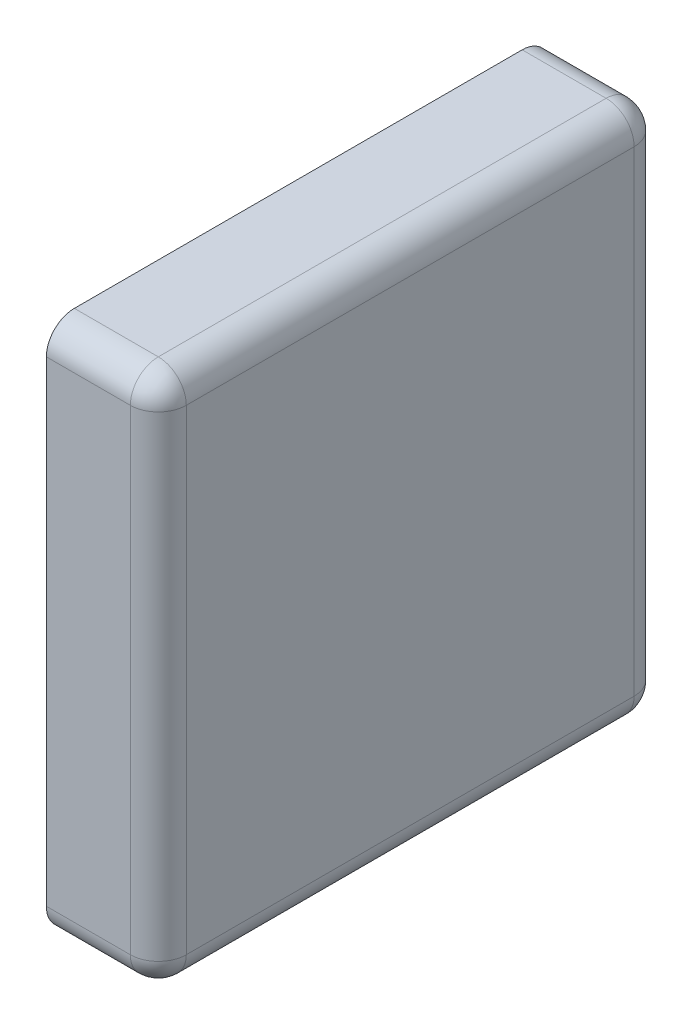
ISO-10303-21;
HEADER;
FILE_DESCRIPTION(('STEP AP214'),'2;1');
FILE_NAME('part.step','',(''),(''),'','','');
FILE_SCHEMA(('AUTOMOTIVE_DESIGN { 1 0 10303 214 1 1 1 1 }'));
ENDSEC;
DATA;
#1=APPLICATION_CONTEXT('core data for automotive mechanical design processes');
#2=APPLICATION_PROTOCOL_DEFINITION('international standard','automotive_design',2000,#1);
#3=PRODUCT_CONTEXT('',#1,'mechanical');
#4=PRODUCT('Part','Part','',(#3));
#5=PRODUCT_RELATED_PRODUCT_CATEGORY('part','',(#4));
#6=PRODUCT_DEFINITION_FORMATION('','',#4);
#7=PRODUCT_DEFINITION_CONTEXT('part definition',#1,'design');
#8=PRODUCT_DEFINITION('design','',#6,#7);
#9=PRODUCT_DEFINITION_SHAPE('','',#8);
#10=(LENGTH_UNIT() NAMED_UNIT(*) SI_UNIT(.MILLI.,.METRE.));
#11=(NAMED_UNIT(*) PLANE_ANGLE_UNIT() SI_UNIT($,.RADIAN.));
#12=(NAMED_UNIT(*) SI_UNIT($,.STERADIAN.) SOLID_ANGLE_UNIT());
#13=UNCERTAINTY_MEASURE_WITH_UNIT(LENGTH_MEASURE(1.E-05),#10,'distance_accuracy_value','');
#14=(GEOMETRIC_REPRESENTATION_CONTEXT(3) GLOBAL_UNCERTAINTY_ASSIGNED_CONTEXT((#13)) GLOBAL_UNIT_ASSIGNED_CONTEXT((#10,
#11,#12)) REPRESENTATION_CONTEXT('',''));
#15=CARTESIAN_POINT('',(0.,0.,0.));
#16=DIRECTION('',(0.,0.,1.));
#17=DIRECTION('',(1.,0.,0.));
#18=AXIS2_PLACEMENT_3D('',#15,#16,#17);
#19=CARTESIAN_POINT('',(1.75,0.,0.));
#20=DIRECTION('',(1.,0.,0.));
#21=DIRECTION('',(0.,0.,-1.));
#22=AXIS2_PLACEMENT_3D('',#19,#20,#21);
#23=PLANE('',#22);
#24=DIRECTION('',(0.,0.,1.));
#25=VECTOR('',#24,1.);
#26=CARTESIAN_POINT('',(1.75,0.9,0.));
#27=LINE('',#26,#25);
#28=CARTESIAN_POINT('',(1.75,0.9,0.85));
#29=VERTEX_POINT('',#28);
#30=CARTESIAN_POINT('',(1.75,0.9,0.05));
#31=VERTEX_POINT('',#30);
#32=EDGE_CURVE('E175',#29,#31,#27,.F.);
#33=ORIENTED_EDGE('',*,*,#32,.F.);
#34=DIRECTION('',(0.,1.,0.));
#35=VECTOR('',#34,1.);
#36=CARTESIAN_POINT('',(1.75,0.,0.85));
#37=LINE('',#36,#35);
#38=CARTESIAN_POINT('',(1.75,0.05,0.85));
#39=VERTEX_POINT('',#38);
#40=EDGE_CURVE('E165',#39,#29,#37,.T.);
#41=ORIENTED_EDGE('',*,*,#40,.F.);
#42=DIRECTION('',(0.,0.,1.));
#43=VECTOR('',#42,1.);
#44=CARTESIAN_POINT('',(1.75,0.05,0.));
#45=LINE('',#44,#43);
#46=CARTESIAN_POINT('',(1.75,0.05,0.05));
#47=VERTEX_POINT('',#46);
#48=EDGE_CURVE('E211',#47,#39,#45,.T.);
#49=ORIENTED_EDGE('',*,*,#48,.F.);
#50=DIRECTION('',(0.,1.,0.));
#51=VECTOR('',#50,1.);
#52=CARTESIAN_POINT('',(1.75,0.,0.05));
#53=LINE('',#52,#51);
#54=EDGE_CURVE('E227',#31,#47,#53,.F.);
#55=ORIENTED_EDGE('',*,*,#54,.F.);
#56=EDGE_LOOP('',(#33,#41,#49,#55));
#57=FACE_BOUND('',#56,.T.);
#58=ADVANCED_FACE('F17',(#57),#23,.T.);
#59=CARTESIAN_POINT('',(1.7,0.05,0.));
#60=DIRECTION('',(0.,0.,1.));
#61=DIRECTION('',(1.,0.,0.));
#62=AXIS2_PLACEMENT_3D('',#59,#60,#61);
#63=CYLINDRICAL_SURFACE('',#62,0.05);
#64=CARTESIAN_POINT('',(1.7,0.05,0.05));
#65=DIRECTION('',(0.,-9.5846697953635E-13,-1.));
#66=DIRECTION('',(1.,0.,0.));
#67=AXIS2_PLACEMENT_3D('',#64,#65,#66);
#68=CIRCLE('',#67,0.05);
#69=CARTESIAN_POINT('',(1.7,0.,0.050000000000012));
#70=VERTEX_POINT('',#69);
#71=EDGE_CURVE('E207',#47,#70,#68,.T.);
#72=ORIENTED_EDGE('',*,*,#71,.F.);
#73=ORIENTED_EDGE('',*,*,#48,.T.);
#74=CARTESIAN_POINT('',(1.7,0.05,0.85));
#75=DIRECTION('',(0.,0.,-1.));
#76=DIRECTION('',(1.,0.,0.));
#77=AXIS2_PLACEMENT_3D('',#74,#75,#76);
#78=CIRCLE('',#77,0.05);
#79=CARTESIAN_POINT('',(1.7,0.,0.85));
#80=VERTEX_POINT('',#79);
#81=EDGE_CURVE('E284',#80,#39,#78,.F.);
#82=ORIENTED_EDGE('',*,*,#81,.F.);
#83=DIRECTION('',(0.,0.,1.));
#84=VECTOR('',#83,1.);
#85=CARTESIAN_POINT('',(1.7,0.,0.));
#86=LINE('',#85,#84);
#87=EDGE_CURVE('E289',#80,#70,#86,.F.);
#88=ORIENTED_EDGE('',*,*,#87,.T.);
#89=EDGE_LOOP('',(#72,#73,#82,#88));
#90=FACE_BOUND('',#89,.T.);
#91=ADVANCED_FACE('F200',(#90),#63,.T.);
#92=CARTESIAN_POINT('',(1.7,0.05,0.05));
#93=DIRECTION('',(1.,0.,0.));
#94=DIRECTION('',(0.,1.,0.));
#95=AXIS2_PLACEMENT_3D('',#92,#93,#94);
#96=SPHERICAL_SURFACE('',#95,0.05);
#97=CARTESIAN_POINT('',(1.7,0.05,0.05));
#98=DIRECTION('',(1.,0.,0.));
#99=DIRECTION('',(0.,0.,-1.));
#100=AXIS2_PLACEMENT_3D('',#97,#98,#99);
#101=CIRCLE('',#100,0.05);
#102=CARTESIAN_POINT('',(1.7,0.05,0.));
#103=VERTEX_POINT('',#102);
#104=EDGE_CURVE('E124',#103,#70,#101,.F.);
#105=ORIENTED_EDGE('',*,*,#104,.F.);
#106=CARTESIAN_POINT('',(1.7,0.05,0.05));
#107=DIRECTION('',(0.,1.,0.));
#108=DIRECTION('',(0.,0.,1.));
#109=AXIS2_PLACEMENT_3D('',#106,#107,#108);
#110=CIRCLE('',#109,0.05);
#111=EDGE_CURVE('E210',#47,#103,#110,.T.);
#112=ORIENTED_EDGE('',*,*,#111,.F.);
#113=ORIENTED_EDGE('',*,*,#71,.T.);
#114=EDGE_LOOP('',(#105,#112,#113));
#115=FACE_BOUND('',#114,.T.);
#116=ADVANCED_FACE('F196',(#115),#96,.T.);
#117=CARTESIAN_POINT('',(1.7,0.,0.05));
#118=DIRECTION('',(0.,1.,0.));
#119=DIRECTION('',(0.,0.,1.));
#120=AXIS2_PLACEMENT_3D('',#117,#118,#119);
#121=CYLINDRICAL_SURFACE('',#120,0.05);
#122=CARTESIAN_POINT('',(1.7,0.9,0.05));
#123=DIRECTION('',(0.,1.,0.));
#124=DIRECTION('',(1.,0.,0.));
#125=AXIS2_PLACEMENT_3D('',#122,#123,#124);
#126=CIRCLE('',#125,0.05);
#127=CARTESIAN_POINT('',(1.7,0.9,0.));
#128=VERTEX_POINT('',#127);
#129=EDGE_CURVE('E187',#31,#128,#126,.T.);
#130=ORIENTED_EDGE('',*,*,#129,.F.);
#131=ORIENTED_EDGE('',*,*,#54,.T.);
#132=ORIENTED_EDGE('',*,*,#111,.T.);
#133=DIRECTION('',(0.,1.,0.));
#134=VECTOR('',#133,1.);
#135=CARTESIAN_POINT('',(1.7,0.,0.));
#136=LINE('',#135,#134);
#137=EDGE_CURVE('E74',#103,#128,#136,.T.);
#138=ORIENTED_EDGE('',*,*,#137,.T.);
#139=EDGE_LOOP('',(#130,#131,#132,#138));
#140=FACE_BOUND('',#139,.T.);
#141=ADVANCED_FACE('F192',(#140),#121,.T.);
#142=CARTESIAN_POINT('',(1.7,0.9,0.05));
#143=DIRECTION('',(1.,0.,0.));
#144=DIRECTION('',(0.,1.,0.));
#145=AXIS2_PLACEMENT_3D('',#142,#143,#144);
#146=SPHERICAL_SURFACE('',#145,0.05);
#147=CARTESIAN_POINT('',(1.7,0.9,0.05));
#148=DIRECTION('',(1.,0.,0.));
#149=DIRECTION('',(0.,0.,-1.));
#150=AXIS2_PLACEMENT_3D('',#147,#148,#149);
#151=CIRCLE('',#150,0.05);
#152=CARTESIAN_POINT('',(1.7,0.95,0.05));
#153=VERTEX_POINT('',#152);
#154=EDGE_CURVE('E118',#153,#128,#151,.F.);
#155=ORIENTED_EDGE('',*,*,#154,.F.);
#156=CARTESIAN_POINT('',(1.7,0.9,0.05));
#157=DIRECTION('',(0.,0.,1.));
#158=DIRECTION('',(1.,0.,0.));
#159=AXIS2_PLACEMENT_3D('',#156,#157,#158);
#160=CIRCLE('',#159,0.05);
#161=EDGE_CURVE('E166',#31,#153,#160,.T.);
#162=ORIENTED_EDGE('',*,*,#161,.F.);
#163=ORIENTED_EDGE('',*,*,#129,.T.);
#164=EDGE_LOOP('',(#155,#162,#163));
#165=FACE_BOUND('',#164,.T.);
#166=ADVANCED_FACE('F189',(#165),#146,.T.);
#167=CARTESIAN_POINT('',(1.7,0.9,0.));
#168=DIRECTION('',(0.,0.,1.));
#169=DIRECTION('',(1.,0.,0.));
#170=AXIS2_PLACEMENT_3D('',#167,#168,#169);
#171=CYLINDRICAL_SURFACE('',#170,0.05);
#172=DIRECTION('',(0.,0.,1.));
#173=VECTOR('',#172,1.);
#174=CARTESIAN_POINT('',(1.7,0.95,0.));
#175=LINE('',#174,#173);
#176=CARTESIAN_POINT('',(1.7,0.95,0.849999999999904));
#177=VERTEX_POINT('',#176);
#178=EDGE_CURVE('E109',#177,#153,#175,.F.);
#179=ORIENTED_EDGE('',*,*,#178,.F.);
#180=CARTESIAN_POINT('',(1.7,0.9,0.85));
#181=DIRECTION('',(0.,7.66605163745165E-12,1.));
#182=DIRECTION('',(1.,0.,0.));
#183=AXIS2_PLACEMENT_3D('',#180,#181,#182);
#184=CIRCLE('',#183,0.05);
#185=EDGE_CURVE('E162',#29,#177,#184,.T.);
#186=ORIENTED_EDGE('',*,*,#185,.F.);
#187=ORIENTED_EDGE('',*,*,#32,.T.);
#188=ORIENTED_EDGE('',*,*,#161,.T.);
#189=EDGE_LOOP('',(#179,#186,#187,#188));
#190=FACE_BOUND('',#189,.T.);
#191=ADVANCED_FACE('F154',(#190),#171,.T.);
#192=CARTESIAN_POINT('',(1.7,0.9,0.85));
#193=DIRECTION('',(1.,0.,0.));
#194=DIRECTION('',(0.,0.,1.));
#195=AXIS2_PLACEMENT_3D('',#192,#193,#194);
#196=SPHERICAL_SURFACE('',#195,0.05);
#197=CARTESIAN_POINT('',(1.7,0.9,0.85));
#198=DIRECTION('',(1.,0.,0.));
#199=DIRECTION('',(0.,0.,-1.));
#200=AXIS2_PLACEMENT_3D('',#197,#198,#199);
#201=CIRCLE('',#200,0.05);
#202=CARTESIAN_POINT('',(1.7,0.9,0.9));
#203=VERTEX_POINT('',#202);
#204=EDGE_CURVE('E108',#203,#177,#201,.F.);
#205=ORIENTED_EDGE('',*,*,#204,.F.);
#206=CARTESIAN_POINT('',(1.7,0.9,0.85));
#207=DIRECTION('',(0.,1.,0.));
#208=DIRECTION('',(0.,0.,1.));
#209=AXIS2_PLACEMENT_3D('',#206,#207,#208);
#210=CIRCLE('',#209,0.05);
#211=EDGE_CURVE('E220',#29,#203,#210,.F.);
#212=ORIENTED_EDGE('',*,*,#211,.F.);
#213=ORIENTED_EDGE('',*,*,#185,.T.);
#214=EDGE_LOOP('',(#205,#212,#213));
#215=FACE_BOUND('',#214,.T.);
#216=ADVANCED_FACE('F149',(#215),#196,.T.);
#217=CARTESIAN_POINT('',(1.7,0.,0.85));
#218=DIRECTION('',(0.,1.,0.));
#219=DIRECTION('',(0.,0.,1.));
#220=AXIS2_PLACEMENT_3D('',#217,#218,#219);
#221=CYLINDRICAL_SURFACE('',#220,0.05);
#222=DIRECTION('',(0.,1.,0.));
#223=VECTOR('',#222,1.);
#224=CARTESIAN_POINT('',(1.7,0.,0.9));
#225=LINE('',#224,#223);
#226=CARTESIAN_POINT('',(1.7,0.05,0.9));
#227=VERTEX_POINT('',#226);
#228=EDGE_CURVE('E103',#227,#203,#225,.T.);
#229=ORIENTED_EDGE('',*,*,#228,.F.);
#230=CARTESIAN_POINT('',(1.7,0.05,0.85));
#231=DIRECTION('',(0.,-1.,0.));
#232=DIRECTION('',(1.,0.,0.));
#233=AXIS2_PLACEMENT_3D('',#230,#231,#232);
#234=CIRCLE('',#233,0.05);
#235=EDGE_CURVE('E136',#39,#227,#234,.T.);
#236=ORIENTED_EDGE('',*,*,#235,.F.);
#237=ORIENTED_EDGE('',*,*,#40,.T.);
#238=ORIENTED_EDGE('',*,*,#211,.T.);
#239=EDGE_LOOP('',(#229,#236,#237,#238));
#240=FACE_BOUND('',#239,.T.);
#241=ADVANCED_FACE('F144',(#240),#221,.T.);
#242=CARTESIAN_POINT('',(1.7,0.05,0.85));
#243=DIRECTION('',(1.,0.,0.));
#244=DIRECTION('',(0.,-1.,0.));
#245=AXIS2_PLACEMENT_3D('',#242,#243,#244);
#246=SPHERICAL_SURFACE('',#245,0.05);
#247=CARTESIAN_POINT('',(1.7,0.05,0.85));
#248=DIRECTION('',(1.,0.,0.));
#249=DIRECTION('',(0.,0.,-1.));
#250=AXIS2_PLACEMENT_3D('',#247,#248,#249);
#251=CIRCLE('',#250,0.05);
#252=EDGE_CURVE('E90',#80,#227,#251,.F.);
#253=ORIENTED_EDGE('',*,*,#252,.F.);
#254=ORIENTED_EDGE('',*,*,#81,.T.);
#255=ORIENTED_EDGE('',*,*,#235,.T.);
#256=EDGE_LOOP('',(#253,#254,#255));
#257=FACE_BOUND('',#256,.T.);
#258=ADVANCED_FACE('F139',(#257),#246,.T.);
#259=CARTESIAN_POINT('',(0.,0.,0.));
#260=DIRECTION('',(0.,1.,0.));
#261=DIRECTION('',(0.,0.,1.));
#262=AXIS2_PLACEMENT_3D('',#259,#260,#261);
#263=PLANE('',#262);
#264=DIRECTION('',(1.,0.,0.));
#265=VECTOR('',#264,1.);
#266=CARTESIAN_POINT('',(0.,0.,0.85));
#267=LINE('',#266,#265);
#268=CARTESIAN_POINT('',(1.55,0.,0.85));
#269=VERTEX_POINT('',#268);
#270=EDGE_CURVE('E96',#269,#80,#267,.T.);
#271=ORIENTED_EDGE('',*,*,#270,.F.);
#272=DIRECTION('',(0.,0.,-1.));
#273=VECTOR('',#272,1.);
#274=CARTESIAN_POINT('',(1.55,0.,0.));
#275=LINE('',#274,#273);
#276=CARTESIAN_POINT('',(1.55,0.,0.05));
#277=VERTEX_POINT('',#276);
#278=EDGE_CURVE('E86',#269,#277,#275,.T.);
#279=ORIENTED_EDGE('',*,*,#278,.T.);
#280=DIRECTION('',(1.,0.,0.));
#281=VECTOR('',#280,1.);
#282=CARTESIAN_POINT('',(0.,0.,0.05));
#283=LINE('',#282,#281);
#284=EDGE_CURVE('E60',#70,#277,#283,.F.);
#285=ORIENTED_EDGE('',*,*,#284,.F.);
#286=ORIENTED_EDGE('',*,*,#87,.F.);
#287=EDGE_LOOP('',(#271,#279,#285,#286));
#288=FACE_BOUND('',#287,.T.);
#289=ADVANCED_FACE('F143',(#288),#263,.F.);
#290=CARTESIAN_POINT('',(0.,0.05,0.05));
#291=DIRECTION('',(1.,0.,0.));
#292=DIRECTION('',(0.,0.,-1.));
#293=AXIS2_PLACEMENT_3D('',#290,#291,#292);
#294=CYLINDRICAL_SURFACE('',#293,0.05);
#295=ORIENTED_EDGE('',*,*,#104,.T.);
#296=ORIENTED_EDGE('',*,*,#284,.T.);
#297=CARTESIAN_POINT('',(1.55,0.05,0.05));
#298=DIRECTION('',(1.,0.,0.));
#299=DIRECTION('',(0.,0.,-1.));
#300=AXIS2_PLACEMENT_3D('',#297,#298,#299);
#301=CIRCLE('',#300,0.05);
#302=CARTESIAN_POINT('',(1.55,0.05,0.));
#303=VERTEX_POINT('',#302);
#304=EDGE_CURVE('E20',#277,#303,#301,.T.);
#305=ORIENTED_EDGE('',*,*,#304,.T.);
#306=DIRECTION('',(1.,0.,0.));
#307=VECTOR('',#306,1.);
#308=CARTESIAN_POINT('',(0.,0.05,0.));
#309=LINE('',#308,#307);
#310=EDGE_CURVE('E67',#303,#103,#309,.T.);
#311=ORIENTED_EDGE('',*,*,#310,.T.);
#312=EDGE_LOOP('',(#295,#296,#305,#311));
#313=FACE_BOUND('',#312,.T.);
#314=ADVANCED_FACE('F85',(#313),#294,.T.);
#315=CARTESIAN_POINT('',(0.,0.,0.));
#316=DIRECTION('',(0.,0.,1.));
#317=DIRECTION('',(1.,0.,0.));
#318=AXIS2_PLACEMENT_3D('',#315,#316,#317);
#319=PLANE('',#318);
#320=ORIENTED_EDGE('',*,*,#137,.F.);
#321=ORIENTED_EDGE('',*,*,#310,.F.);
#322=DIRECTION('',(0.,1.,0.));
#323=VECTOR('',#322,1.);
#324=CARTESIAN_POINT('',(1.55,0.,0.));
#325=LINE('',#324,#323);
#326=CARTESIAN_POINT('',(1.55,0.9,0.));
#327=VERTEX_POINT('',#326);
#328=EDGE_CURVE('E71',#303,#327,#325,.T.);
#329=ORIENTED_EDGE('',*,*,#328,.T.);
#330=DIRECTION('',(1.,0.,0.));
#331=VECTOR('',#330,1.);
#332=CARTESIAN_POINT('',(0.,0.9,0.));
#333=LINE('',#332,#331);
#334=EDGE_CURVE('E114',#128,#327,#333,.F.);
#335=ORIENTED_EDGE('',*,*,#334,.F.);
#336=EDGE_LOOP('',(#320,#321,#329,#335));
#337=FACE_BOUND('',#336,.T.);
#338=ADVANCED_FACE('F69',(#337),#319,.F.);
#339=CARTESIAN_POINT('',(0.,0.9,0.05));
#340=DIRECTION('',(1.,0.,0.));
#341=DIRECTION('',(0.,0.,-1.));
#342=AXIS2_PLACEMENT_3D('',#339,#340,#341);
#343=CYLINDRICAL_SURFACE('',#342,0.05);
#344=ORIENTED_EDGE('',*,*,#334,.T.);
#345=CARTESIAN_POINT('',(1.55,0.9,0.05));
#346=DIRECTION('',(1.,0.,0.));
#347=DIRECTION('',(0.,0.,-1.));
#348=AXIS2_PLACEMENT_3D('',#345,#346,#347);
#349=CIRCLE('',#348,0.05);
#350=CARTESIAN_POINT('',(1.55,0.95,0.05));
#351=VERTEX_POINT('',#350);
#352=EDGE_CURVE('E83',#327,#351,#349,.T.);
#353=ORIENTED_EDGE('',*,*,#352,.T.);
#354=DIRECTION('',(1.,0.,0.));
#355=VECTOR('',#354,1.);
#356=CARTESIAN_POINT('',(0.,0.95,0.05));
#357=LINE('',#356,#355);
#358=EDGE_CURVE('E112',#153,#351,#357,.F.);
#359=ORIENTED_EDGE('',*,*,#358,.F.);
#360=ORIENTED_EDGE('',*,*,#154,.T.);
#361=EDGE_LOOP('',(#344,#353,#359,#360));
#362=FACE_BOUND('',#361,.T.);
#363=ADVANCED_FACE('F312',(#362),#343,.T.);
#364=CARTESIAN_POINT('',(0.,0.95,0.));
#365=DIRECTION('',(0.,1.,0.));
#366=DIRECTION('',(0.,0.,1.));
#367=AXIS2_PLACEMENT_3D('',#364,#365,#366);
#368=PLANE('',#367);
#369=DIRECTION('',(1.,0.,0.));
#370=VECTOR('',#369,1.);
#371=CARTESIAN_POINT('',(0.,0.95,0.85));
#372=LINE('',#371,#370);
#373=CARTESIAN_POINT('',(1.55,0.95,0.85));
#374=VERTEX_POINT('',#373);
#375=EDGE_CURVE('E106',#177,#374,#372,.F.);
#376=ORIENTED_EDGE('',*,*,#375,.F.);
#377=ORIENTED_EDGE('',*,*,#178,.T.);
#378=ORIENTED_EDGE('',*,*,#358,.T.);
#379=DIRECTION('',(0.,0.,-1.));
#380=VECTOR('',#379,1.);
#381=CARTESIAN_POINT('',(1.55,0.95,0.));
#382=LINE('',#381,#380);
#383=EDGE_CURVE('E234',#351,#374,#382,.F.);
#384=ORIENTED_EDGE('',*,*,#383,.T.);
#385=EDGE_LOOP('',(#376,#377,#378,#384));
#386=FACE_BOUND('',#385,.T.);
#387=ADVANCED_FACE('F252',(#386),#368,.T.);
#388=CARTESIAN_POINT('',(0.,0.9,0.85));
#389=DIRECTION('',(1.,0.,0.));
#390=DIRECTION('',(0.,0.,-1.));
#391=AXIS2_PLACEMENT_3D('',#388,#389,#390);
#392=CYLINDRICAL_SURFACE('',#391,0.05);
#393=DIRECTION('',(1.,0.,0.));
#394=VECTOR('',#393,1.);
#395=CARTESIAN_POINT('',(0.,0.9,0.9));
#396=LINE('',#395,#394);
#397=CARTESIAN_POINT('',(1.55,0.9,0.9));
#398=VERTEX_POINT('',#397);
#399=EDGE_CURVE('E99',#203,#398,#396,.F.);
#400=ORIENTED_EDGE('',*,*,#399,.F.);
#401=ORIENTED_EDGE('',*,*,#204,.T.);
#402=ORIENTED_EDGE('',*,*,#375,.T.);
#403=CARTESIAN_POINT('',(1.55,0.9,0.85));
#404=DIRECTION('',(1.,0.,0.));
#405=DIRECTION('',(0.,0.,-1.));
#406=AXIS2_PLACEMENT_3D('',#403,#404,#405);
#407=CIRCLE('',#406,0.05);
#408=EDGE_CURVE('E232',#374,#398,#407,.T.);
#409=ORIENTED_EDGE('',*,*,#408,.T.);
#410=EDGE_LOOP('',(#400,#401,#402,#409));
#411=FACE_BOUND('',#410,.T.);
#412=ADVANCED_FACE('F247',(#411),#392,.T.);
#413=CARTESIAN_POINT('',(0.,0.,0.9));
#414=DIRECTION('',(0.,0.,1.));
#415=DIRECTION('',(1.,0.,0.));
#416=AXIS2_PLACEMENT_3D('',#413,#414,#415);
#417=PLANE('',#416);
#418=ORIENTED_EDGE('',*,*,#228,.T.);
#419=ORIENTED_EDGE('',*,*,#399,.T.);
#420=DIRECTION('',(0.,1.,0.));
#421=VECTOR('',#420,1.);
#422=CARTESIAN_POINT('',(1.55,0.,0.9));
#423=LINE('',#422,#421);
#424=CARTESIAN_POINT('',(1.55,0.05,0.9));
#425=VERTEX_POINT('',#424);
#426=EDGE_CURVE('E26',#398,#425,#423,.F.);
#427=ORIENTED_EDGE('',*,*,#426,.T.);
#428=DIRECTION('',(1.,0.,0.));
#429=VECTOR('',#428,1.);
#430=CARTESIAN_POINT('',(0.,0.05,0.9));
#431=LINE('',#430,#429);
#432=EDGE_CURVE('E34',#227,#425,#431,.F.);
#433=ORIENTED_EDGE('',*,*,#432,.F.);
#434=EDGE_LOOP('',(#418,#419,#427,#433));
#435=FACE_BOUND('',#434,.T.);
#436=ADVANCED_FACE('F243',(#435),#417,.T.);
#437=CARTESIAN_POINT('',(0.,0.05,0.85));
#438=DIRECTION('',(1.,0.,0.));
#439=DIRECTION('',(0.,0.,-1.));
#440=AXIS2_PLACEMENT_3D('',#437,#438,#439);
#441=CYLINDRICAL_SURFACE('',#440,0.05);
#442=ORIENTED_EDGE('',*,*,#432,.T.);
#443=CARTESIAN_POINT('',(1.55,0.05,0.85));
#444=DIRECTION('',(1.,0.,0.));
#445=DIRECTION('',(0.,0.,-1.));
#446=AXIS2_PLACEMENT_3D('',#443,#444,#445);
#447=CIRCLE('',#446,0.05);
#448=EDGE_CURVE('E11',#425,#269,#447,.T.);
#449=ORIENTED_EDGE('',*,*,#448,.T.);
#450=ORIENTED_EDGE('',*,*,#270,.T.);
#451=ORIENTED_EDGE('',*,*,#252,.T.);
#452=EDGE_LOOP('',(#442,#449,#450,#451));
#453=FACE_BOUND('',#452,.T.);
#454=ADVANCED_FACE('F323',(#453),#441,.T.);
#455=CARTESIAN_POINT('',(1.55,0.,0.));
#456=DIRECTION('',(1.,0.,0.));
#457=DIRECTION('',(0.,0.,-1.));
#458=AXIS2_PLACEMENT_3D('',#455,#456,#457);
#459=PLANE('',#458);
#460=ORIENTED_EDGE('',*,*,#426,.F.);
#461=ORIENTED_EDGE('',*,*,#408,.F.);
#462=ORIENTED_EDGE('',*,*,#383,.F.);
#463=ORIENTED_EDGE('',*,*,#352,.F.);
#464=ORIENTED_EDGE('',*,*,#328,.F.);
#465=ORIENTED_EDGE('',*,*,#304,.F.);
#466=ORIENTED_EDGE('',*,*,#278,.F.);
#467=ORIENTED_EDGE('',*,*,#448,.F.);
#468=EDGE_LOOP('',(#460,#461,#462,#463,#464,#465,#466,#467));
#469=FACE_BOUND('',#468,.T.);
#470=ADVANCED_FACE('F79',(#469),#459,.F.);
#471=CLOSED_SHELL('',(#58,#91,#116,#141,#166,#191,#216,#241,#258,#289,#314,#338,#363,#387,#412,
#436,#454,#470));
#472=MANIFOLD_SOLID_BREP('B1',#471);
#473=ADVANCED_BREP_SHAPE_REPRESENTATION('',(#18,#472),#14);
#474=SHAPE_DEFINITION_REPRESENTATION(#9,#473);
ENDSEC;
END-ISO-10303-21;
